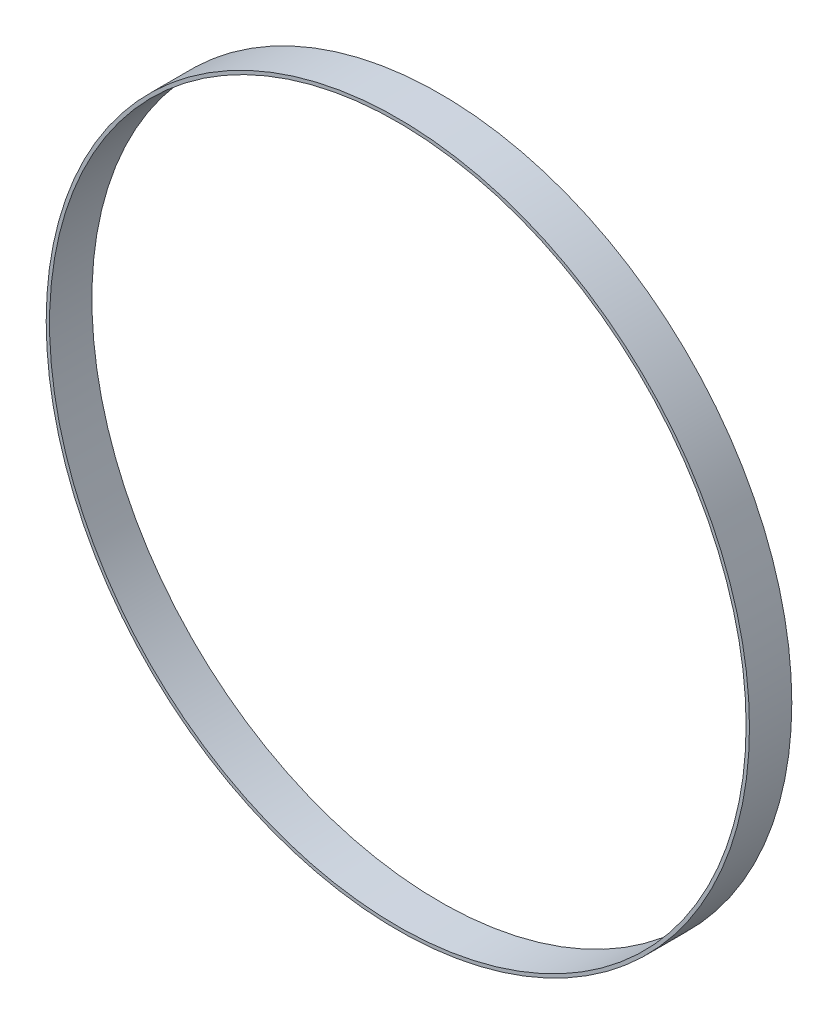
ISO-10303-21;
HEADER;
FILE_DESCRIPTION(('STEP AP214'),'2;1');
FILE_NAME('part.step','',(''),(''),'','','');
FILE_SCHEMA(('AUTOMOTIVE_DESIGN { 1 0 10303 214 1 1 1 1 }'));
ENDSEC;
DATA;
#1=APPLICATION_CONTEXT('core data for automotive mechanical design processes');
#2=APPLICATION_PROTOCOL_DEFINITION('international standard','automotive_design',2000,#1);
#3=PRODUCT_CONTEXT('',#1,'mechanical');
#4=PRODUCT('Part','Part','',(#3));
#5=PRODUCT_RELATED_PRODUCT_CATEGORY('part','',(#4));
#6=PRODUCT_DEFINITION_FORMATION('','',#4);
#7=PRODUCT_DEFINITION_CONTEXT('part definition',#1,'design');
#8=PRODUCT_DEFINITION('design','',#6,#7);
#9=PRODUCT_DEFINITION_SHAPE('','',#8);
#10=(LENGTH_UNIT() NAMED_UNIT(*) SI_UNIT(.MILLI.,.METRE.));
#11=(NAMED_UNIT(*) PLANE_ANGLE_UNIT() SI_UNIT($,.RADIAN.));
#12=(NAMED_UNIT(*) SI_UNIT($,.STERADIAN.) SOLID_ANGLE_UNIT());
#13=UNCERTAINTY_MEASURE_WITH_UNIT(LENGTH_MEASURE(1.E-05),#10,'distance_accuracy_value','');
#14=(GEOMETRIC_REPRESENTATION_CONTEXT(3) GLOBAL_UNCERTAINTY_ASSIGNED_CONTEXT((#13)) GLOBAL_UNIT_ASSIGNED_CONTEXT((#10,
#11,#12)) REPRESENTATION_CONTEXT('',''));
#15=CARTESIAN_POINT('',(0.,0.,0.));
#16=DIRECTION('',(0.,0.,1.));
#17=DIRECTION('',(1.,0.,0.));
#18=AXIS2_PLACEMENT_3D('',#15,#16,#17);
#19=CARTESIAN_POINT('',(0.,0.,10.));
#20=DIRECTION('',(0.,0.,1.));
#21=DIRECTION('',(1.,0.,0.));
#22=AXIS2_PLACEMENT_3D('',#19,#20,#21);
#23=PLANE('',#22);
#24=CARTESIAN_POINT('',(0.,0.,10.));
#25=DIRECTION('',(0.,0.,1.));
#26=DIRECTION('',(1.,0.,0.));
#27=AXIS2_PLACEMENT_3D('',#24,#25,#26);
#28=CIRCLE('',#27,83.05);
#29=CARTESIAN_POINT('',(83.05,0.,10.));
#30=VERTEX_POINT('',#29);
#31=EDGE_CURVE('E10',#30,#30,#28,.T.);
#32=ORIENTED_EDGE('',*,*,#31,.T.);
#33=EDGE_LOOP('',(#32));
#34=FACE_BOUND('',#33,.T.);
#35=CARTESIAN_POINT('',(0.,0.,10.));
#36=DIRECTION('',(0.,0.,1.));
#37=DIRECTION('',(1.,0.,0.));
#38=AXIS2_PLACEMENT_3D('',#35,#36,#37);
#39=CIRCLE('',#38,82.25625);
#40=CARTESIAN_POINT('',(82.25625,0.,10.));
#41=VERTEX_POINT('',#40);
#42=EDGE_CURVE('E42',#41,#41,#39,.T.);
#43=ORIENTED_EDGE('',*,*,#42,.F.);
#44=EDGE_LOOP('',(#43));
#45=FACE_BOUND('',#44,.T.);
#46=ADVANCED_FACE('F31',(#34,#45),#23,.T.);
#47=CARTESIAN_POINT('',(0.,0.,0.));
#48=DIRECTION('',(0.,0.,1.));
#49=DIRECTION('',(1.,0.,0.));
#50=AXIS2_PLACEMENT_3D('',#47,#48,#49);
#51=PLANE('',#50);
#52=CARTESIAN_POINT('',(0.,0.,0.));
#53=DIRECTION('',(0.,0.,1.));
#54=DIRECTION('',(1.,0.,0.));
#55=AXIS2_PLACEMENT_3D('',#52,#53,#54);
#56=CIRCLE('',#55,83.05);
#57=CARTESIAN_POINT('',(83.05,0.,0.));
#58=VERTEX_POINT('',#57);
#59=EDGE_CURVE('E35',#58,#58,#56,.T.);
#60=ORIENTED_EDGE('',*,*,#59,.F.);
#61=EDGE_LOOP('',(#60));
#62=FACE_BOUND('',#61,.T.);
#63=CARTESIAN_POINT('',(0.,0.,0.));
#64=DIRECTION('',(0.,0.,1.));
#65=DIRECTION('',(1.,0.,0.));
#66=AXIS2_PLACEMENT_3D('',#63,#64,#65);
#67=CIRCLE('',#66,82.25625);
#68=CARTESIAN_POINT('',(82.25625,0.,0.));
#69=VERTEX_POINT('',#68);
#70=EDGE_CURVE('E44',#69,#69,#67,.T.);
#71=ORIENTED_EDGE('',*,*,#70,.T.);
#72=EDGE_LOOP('',(#71));
#73=FACE_BOUND('',#72,.T.);
#74=ADVANCED_FACE('F54',(#62,#73),#51,.F.);
#75=CARTESIAN_POINT('',(0.,0.,10.));
#76=DIRECTION('',(0.,0.,-1.));
#77=DIRECTION('',(-1.,0.,0.));
#78=AXIS2_PLACEMENT_3D('',#75,#76,#77);
#79=CYLINDRICAL_SURFACE('',#78,83.05);
#80=ORIENTED_EDGE('',*,*,#31,.F.);
#81=EDGE_LOOP('',(#80));
#82=FACE_BOUND('',#81,.T.);
#83=ORIENTED_EDGE('',*,*,#59,.T.);
#84=EDGE_LOOP('',(#83));
#85=FACE_BOUND('',#84,.T.);
#86=ADVANCED_FACE('F33',(#82,#85),#79,.T.);
#87=CARTESIAN_POINT('',(0.,0.,10.));
#88=DIRECTION('',(0.,0.,-1.));
#89=DIRECTION('',(-1.,0.,0.));
#90=AXIS2_PLACEMENT_3D('',#87,#88,#89);
#91=CYLINDRICAL_SURFACE('',#90,82.25625);
#92=ORIENTED_EDGE('',*,*,#42,.T.);
#93=EDGE_LOOP('',(#92));
#94=FACE_BOUND('',#93,.T.);
#95=ORIENTED_EDGE('',*,*,#70,.F.);
#96=EDGE_LOOP('',(#95));
#97=FACE_BOUND('',#96,.T.);
#98=ADVANCED_FACE('F50',(#94,#97),#91,.F.);
#99=CLOSED_SHELL('',(#46,#74,#86,#98));
#100=MANIFOLD_SOLID_BREP('B2',#99);
#101=ADVANCED_BREP_SHAPE_REPRESENTATION('',(#18,#100),#14);
#102=SHAPE_DEFINITION_REPRESENTATION(#9,#101);
ENDSEC;
END-ISO-10303-21;
